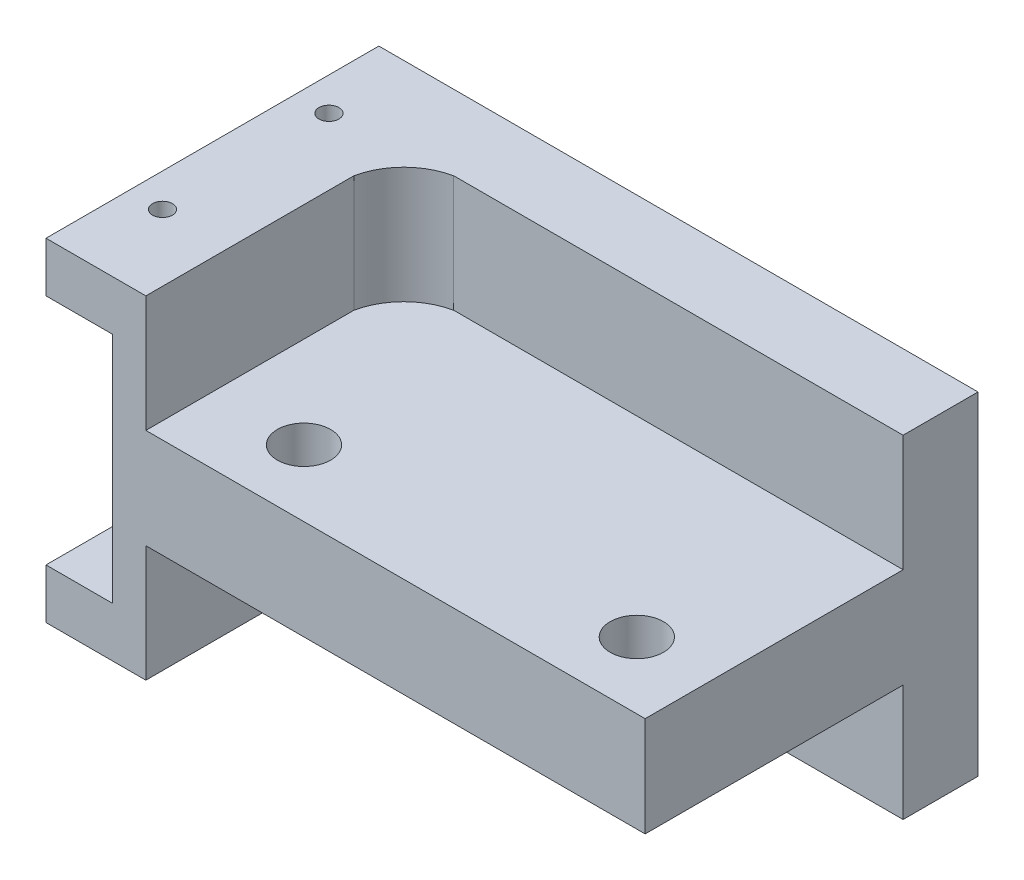
ISO-10303-21;
HEADER;
FILE_DESCRIPTION(('STEP AP214'),'2;1');
FILE_NAME('part.step','',(''),(''),'','','');
FILE_SCHEMA(('AUTOMOTIVE_DESIGN { 1 0 10303 214 1 1 1 1 }'));
ENDSEC;
DATA;
#1=APPLICATION_CONTEXT('core data for automotive mechanical design processes');
#2=APPLICATION_PROTOCOL_DEFINITION('international standard','automotive_design',2000,#1);
#3=PRODUCT_CONTEXT('',#1,'mechanical');
#4=PRODUCT('Part','Part','',(#3));
#5=PRODUCT_RELATED_PRODUCT_CATEGORY('part','',(#4));
#6=PRODUCT_DEFINITION_FORMATION('','',#4);
#7=PRODUCT_DEFINITION_CONTEXT('part definition',#1,'design');
#8=PRODUCT_DEFINITION('design','',#6,#7);
#9=PRODUCT_DEFINITION_SHAPE('','',#8);
#10=(LENGTH_UNIT() NAMED_UNIT(*) SI_UNIT(.MILLI.,.METRE.));
#11=(NAMED_UNIT(*) PLANE_ANGLE_UNIT() SI_UNIT($,.RADIAN.));
#12=(NAMED_UNIT(*) SI_UNIT($,.STERADIAN.) SOLID_ANGLE_UNIT());
#13=UNCERTAINTY_MEASURE_WITH_UNIT(LENGTH_MEASURE(1.E-05),#10,'distance_accuracy_value','');
#14=(GEOMETRIC_REPRESENTATION_CONTEXT(3) GLOBAL_UNCERTAINTY_ASSIGNED_CONTEXT((#13)) GLOBAL_UNIT_ASSIGNED_CONTEXT((#10,
#11,#12)) REPRESENTATION_CONTEXT('',''));
#15=CARTESIAN_POINT('',(0.,0.,0.));
#16=DIRECTION('',(0.,0.,1.));
#17=DIRECTION('',(1.,0.,0.));
#18=AXIS2_PLACEMENT_3D('',#15,#16,#17);
#19=CARTESIAN_POINT('',(17.5,10.,10.));
#20=DIRECTION('',(-1.,0.,0.));
#21=DIRECTION('',(0.,0.,1.));
#22=AXIS2_PLACEMENT_3D('',#19,#20,#21);
#23=PLANE('',#22);
#24=DIRECTION('',(0.,0.,1.));
#25=VECTOR('',#24,1.);
#26=CARTESIAN_POINT('',(17.5,-3.,10.));
#27=LINE('',#26,#25);
#28=CARTESIAN_POINT('',(17.5,-3.,-5.5));
#29=VERTEX_POINT('',#28);
#30=CARTESIAN_POINT('',(17.5,-3.,10.));
#31=VERTEX_POINT('',#30);
#32=EDGE_CURVE('E256',#29,#31,#27,.T.);
#33=ORIENTED_EDGE('',*,*,#32,.F.);
#34=DIRECTION('',(0.,-1.,0.));
#35=VECTOR('',#34,1.);
#36=CARTESIAN_POINT('',(17.5,-3.,-5.5));
#37=LINE('',#36,#35);
#38=CARTESIAN_POINT('',(17.5,-10.,-5.5));
#39=VERTEX_POINT('',#38);
#40=EDGE_CURVE('E264',#29,#39,#37,.T.);
#41=ORIENTED_EDGE('',*,*,#40,.T.);
#42=DIRECTION('',(0.,0.,-1.));
#43=VECTOR('',#42,1.);
#44=CARTESIAN_POINT('',(17.5,-10.,10.));
#45=LINE('',#44,#43);
#46=CARTESIAN_POINT('',(17.5,-10.,-10.));
#47=VERTEX_POINT('',#46);
#48=EDGE_CURVE('E164',#39,#47,#45,.T.);
#49=ORIENTED_EDGE('',*,*,#48,.T.);
#50=DIRECTION('',(0.,-1.,0.));
#51=VECTOR('',#50,1.);
#52=CARTESIAN_POINT('',(17.5,10.,-10.));
#53=LINE('',#52,#51);
#54=CARTESIAN_POINT('',(17.5,10.,-10.));
#55=VERTEX_POINT('',#54);
#56=EDGE_CURVE('E11',#55,#47,#53,.T.);
#57=ORIENTED_EDGE('',*,*,#56,.F.);
#58=DIRECTION('',(0.,0.,-1.));
#59=VECTOR('',#58,1.);
#60=CARTESIAN_POINT('',(17.5,10.,10.));
#61=LINE('',#60,#59);
#62=CARTESIAN_POINT('',(17.5,10.,-5.5));
#63=VERTEX_POINT('',#62);
#64=EDGE_CURVE('E303',#63,#55,#61,.T.);
#65=ORIENTED_EDGE('',*,*,#64,.F.);
#66=DIRECTION('',(0.,1.,0.));
#67=VECTOR('',#66,1.);
#68=CARTESIAN_POINT('',(17.5,3.,-5.5));
#69=LINE('',#68,#67);
#70=CARTESIAN_POINT('',(17.5,3.,-5.5));
#71=VERTEX_POINT('',#70);
#72=EDGE_CURVE('E288',#71,#63,#69,.T.);
#73=ORIENTED_EDGE('',*,*,#72,.F.);
#74=DIRECTION('',(0.,0.,-1.));
#75=VECTOR('',#74,1.);
#76=CARTESIAN_POINT('',(17.5,3.,-5.5));
#77=LINE('',#76,#75);
#78=CARTESIAN_POINT('',(17.5,3.,10.));
#79=VERTEX_POINT('',#78);
#80=EDGE_CURVE('E275',#79,#71,#77,.T.);
#81=ORIENTED_EDGE('',*,*,#80,.F.);
#82=DIRECTION('',(0.,-1.,0.));
#83=VECTOR('',#82,1.);
#84=CARTESIAN_POINT('',(17.5,10.,10.));
#85=LINE('',#84,#83);
#86=EDGE_CURVE('E45',#79,#31,#85,.T.);
#87=ORIENTED_EDGE('',*,*,#86,.T.);
#88=EDGE_LOOP('',(#33,#41,#49,#57,#65,#73,#81,#87));
#89=FACE_BOUND('',#88,.T.);
#90=ADVANCED_FACE('F37',(#89),#23,.F.);
#91=CARTESIAN_POINT('',(-17.5,10.,-10.));
#92=DIRECTION('',(0.,0.,1.));
#93=DIRECTION('',(1.,0.,0.));
#94=AXIS2_PLACEMENT_3D('',#91,#92,#93);
#95=PLANE('',#94);
#96=DIRECTION('',(0.,-1.,0.));
#97=VECTOR('',#96,1.);
#98=CARTESIAN_POINT('',(-14.5,7.,-10.));
#99=LINE('',#98,#97);
#100=CARTESIAN_POINT('',(-14.5,7.,-10.));
#101=VERTEX_POINT('',#100);
#102=CARTESIAN_POINT('',(-14.5,-7.,-10.));
#103=VERTEX_POINT('',#102);
#104=EDGE_CURVE('E212',#101,#103,#99,.T.);
#105=ORIENTED_EDGE('',*,*,#104,.F.);
#106=DIRECTION('',(-1.,0.,0.));
#107=VECTOR('',#106,1.);
#108=CARTESIAN_POINT('',(-14.5,7.,-10.));
#109=LINE('',#108,#107);
#110=CARTESIAN_POINT('',(-18.5,7.,-10.));
#111=VERTEX_POINT('',#110);
#112=EDGE_CURVE('E229',#101,#111,#109,.T.);
#113=ORIENTED_EDGE('',*,*,#112,.T.);
#114=DIRECTION('',(0.,-1.,0.));
#115=VECTOR('',#114,1.);
#116=CARTESIAN_POINT('',(-18.5,10.,-10.));
#117=LINE('',#116,#115);
#118=CARTESIAN_POINT('',(-18.5,10.,-10.));
#119=VERTEX_POINT('',#118);
#120=EDGE_CURVE('E184',#119,#111,#117,.T.);
#121=ORIENTED_EDGE('',*,*,#120,.F.);
#122=DIRECTION('',(-1.,0.,0.));
#123=VECTOR('',#122,1.);
#124=CARTESIAN_POINT('',(-17.5,10.,-10.));
#125=LINE('',#124,#123);
#126=EDGE_CURVE('E305',#55,#119,#125,.T.);
#127=ORIENTED_EDGE('',*,*,#126,.F.);
#128=ORIENTED_EDGE('',*,*,#56,.T.);
#129=DIRECTION('',(-1.,0.,0.));
#130=VECTOR('',#129,1.);
#131=CARTESIAN_POINT('',(-17.5,-10.,-10.));
#132=LINE('',#131,#130);
#133=CARTESIAN_POINT('',(-18.5,-10.,-10.));
#134=VERTEX_POINT('',#133);
#135=EDGE_CURVE('E152',#47,#134,#132,.T.);
#136=ORIENTED_EDGE('',*,*,#135,.T.);
#137=DIRECTION('',(0.,-1.,0.));
#138=VECTOR('',#137,1.);
#139=CARTESIAN_POINT('',(-18.5,-7.,-10.));
#140=LINE('',#139,#138);
#141=CARTESIAN_POINT('',(-18.5,-7.,-10.));
#142=VERTEX_POINT('',#141);
#143=EDGE_CURVE('E158',#142,#134,#140,.T.);
#144=ORIENTED_EDGE('',*,*,#143,.F.);
#145=DIRECTION('',(-1.,0.,0.));
#146=VECTOR('',#145,1.);
#147=CARTESIAN_POINT('',(-14.5,-7.,-10.));
#148=LINE('',#147,#146);
#149=EDGE_CURVE('E228',#103,#142,#148,.T.);
#150=ORIENTED_EDGE('',*,*,#149,.F.);
#151=EDGE_LOOP('',(#105,#113,#121,#127,#128,#136,#144,#150));
#152=FACE_BOUND('',#151,.T.);
#153=ADVANCED_FACE('F155',(#152),#95,.F.);
#154=CARTESIAN_POINT('',(-17.5,10.,10.));
#155=DIRECTION('',(0.,0.,-1.));
#156=DIRECTION('',(-1.,0.,0.));
#157=AXIS2_PLACEMENT_3D('',#154,#155,#156);
#158=PLANE('',#157);
#159=DIRECTION('',(1.,0.,0.));
#160=VECTOR('',#159,1.);
#161=CARTESIAN_POINT('',(-17.5,10.,10.));
#162=LINE('',#161,#160);
#163=CARTESIAN_POINT('',(-18.5,10.,10.));
#164=VERTEX_POINT('',#163);
#165=CARTESIAN_POINT('',(-12.5,10.,10.));
#166=VERTEX_POINT('',#165);
#167=EDGE_CURVE('E307',#164,#166,#162,.T.);
#168=ORIENTED_EDGE('',*,*,#167,.F.);
#169=DIRECTION('',(0.,1.,0.));
#170=VECTOR('',#169,1.);
#171=CARTESIAN_POINT('',(-18.5,10.,10.));
#172=LINE('',#171,#170);
#173=CARTESIAN_POINT('',(-18.5,7.,10.));
#174=VERTEX_POINT('',#173);
#175=EDGE_CURVE('E190',#174,#164,#172,.T.);
#176=ORIENTED_EDGE('',*,*,#175,.F.);
#177=DIRECTION('',(-1.,0.,0.));
#178=VECTOR('',#177,1.);
#179=CARTESIAN_POINT('',(-14.5,7.,10.));
#180=LINE('',#179,#178);
#181=CARTESIAN_POINT('',(-14.5,7.,10.));
#182=VERTEX_POINT('',#181);
#183=EDGE_CURVE('E232',#182,#174,#180,.T.);
#184=ORIENTED_EDGE('',*,*,#183,.F.);
#185=DIRECTION('',(0.,1.,0.));
#186=VECTOR('',#185,1.);
#187=CARTESIAN_POINT('',(-14.5,7.,10.));
#188=LINE('',#187,#186);
#189=CARTESIAN_POINT('',(-14.5,-7.,10.));
#190=VERTEX_POINT('',#189);
#191=EDGE_CURVE('E223',#190,#182,#188,.T.);
#192=ORIENTED_EDGE('',*,*,#191,.F.);
#193=DIRECTION('',(-1.,0.,0.));
#194=VECTOR('',#193,1.);
#195=CARTESIAN_POINT('',(-14.5,-7.,10.));
#196=LINE('',#195,#194);
#197=CARTESIAN_POINT('',(-18.5,-7.,10.));
#198=VERTEX_POINT('',#197);
#199=EDGE_CURVE('E234',#190,#198,#196,.T.);
#200=ORIENTED_EDGE('',*,*,#199,.T.);
#201=DIRECTION('',(0.,1.,0.));
#202=VECTOR('',#201,1.);
#203=CARTESIAN_POINT('',(-18.5,-7.,10.));
#204=LINE('',#203,#202);
#205=CARTESIAN_POINT('',(-18.5,-10.,10.));
#206=VERTEX_POINT('',#205);
#207=EDGE_CURVE('E174',#206,#198,#204,.T.);
#208=ORIENTED_EDGE('',*,*,#207,.F.);
#209=DIRECTION('',(1.,0.,0.));
#210=VECTOR('',#209,1.);
#211=CARTESIAN_POINT('',(-17.5,-10.,10.));
#212=LINE('',#211,#210);
#213=CARTESIAN_POINT('',(-12.5,-10.,10.));
#214=VERTEX_POINT('',#213);
#215=EDGE_CURVE('E163',#206,#214,#212,.T.);
#216=ORIENTED_EDGE('',*,*,#215,.T.);
#217=DIRECTION('',(0.,-1.,0.));
#218=VECTOR('',#217,1.);
#219=CARTESIAN_POINT('',(-12.5,-3.,10.));
#220=LINE('',#219,#218);
#221=CARTESIAN_POINT('',(-12.5,-3.,10.));
#222=VERTEX_POINT('',#221);
#223=EDGE_CURVE('E61',#222,#214,#220,.T.);
#224=ORIENTED_EDGE('',*,*,#223,.F.);
#225=DIRECTION('',(-1.,0.,0.));
#226=VECTOR('',#225,1.);
#227=CARTESIAN_POINT('',(-12.5,-3.,10.));
#228=LINE('',#227,#226);
#229=EDGE_CURVE('E243',#31,#222,#228,.T.);
#230=ORIENTED_EDGE('',*,*,#229,.F.);
#231=ORIENTED_EDGE('',*,*,#86,.F.);
#232=DIRECTION('',(1.,0.,0.));
#233=VECTOR('',#232,1.);
#234=CARTESIAN_POINT('',(17.5,3.,10.));
#235=LINE('',#234,#233);
#236=CARTESIAN_POINT('',(-12.5,3.,10.));
#237=VERTEX_POINT('',#236);
#238=EDGE_CURVE('E273',#237,#79,#235,.T.);
#239=ORIENTED_EDGE('',*,*,#238,.F.);
#240=DIRECTION('',(0.,1.,0.));
#241=VECTOR('',#240,1.);
#242=CARTESIAN_POINT('',(-12.5,3.,10.));
#243=LINE('',#242,#241);
#244=EDGE_CURVE('E295',#237,#166,#243,.T.);
#245=ORIENTED_EDGE('',*,*,#244,.T.);
#246=EDGE_LOOP('',(#168,#176,#184,#192,#200,#208,#216,#224,#230,#231,#239,#245));
#247=FACE_BOUND('',#246,.T.);
#248=ADVANCED_FACE('F333',(#247),#158,.F.);
#249=CARTESIAN_POINT('',(0.,10.,0.));
#250=DIRECTION('',(0.,-1.,0.));
#251=DIRECTION('',(0.,0.,-1.));
#252=AXIS2_PLACEMENT_3D('',#249,#250,#251);
#253=PLANE('',#252);
#254=CARTESIAN_POINT('',(-16.5,10.,-5.));
#255=DIRECTION('',(0.,1.,0.));
#256=DIRECTION('',(0.,0.,1.));
#257=AXIS2_PLACEMENT_3D('',#254,#255,#256);
#258=CIRCLE('',#257,0.6);
#259=CARTESIAN_POINT('',(-16.5,10.,-4.4));
#260=VERTEX_POINT('',#259);
#261=EDGE_CURVE('E213',#260,#260,#258,.T.);
#262=ORIENTED_EDGE('',*,*,#261,.F.);
#263=EDGE_LOOP('',(#262));
#264=FACE_BOUND('',#263,.T.);
#265=CARTESIAN_POINT('',(-16.5,10.,5.));
#266=DIRECTION('',(0.,1.,0.));
#267=DIRECTION('',(0.,0.,1.));
#268=AXIS2_PLACEMENT_3D('',#265,#266,#267);
#269=CIRCLE('',#268,0.6);
#270=CARTESIAN_POINT('',(-16.5,10.,5.6));
#271=VERTEX_POINT('',#270);
#272=EDGE_CURVE('E200',#271,#271,#269,.T.);
#273=ORIENTED_EDGE('',*,*,#272,.F.);
#274=EDGE_LOOP('',(#273));
#275=FACE_BOUND('',#274,.T.);
#276=ORIENTED_EDGE('',*,*,#167,.T.);
#277=DIRECTION('',(0.,0.,1.));
#278=VECTOR('',#277,1.);
#279=CARTESIAN_POINT('',(-12.5,10.,10.));
#280=LINE('',#279,#278);
#281=CARTESIAN_POINT('',(-12.5,10.,-2.5));
#282=VERTEX_POINT('',#281);
#283=EDGE_CURVE('E276',#282,#166,#280,.T.);
#284=ORIENTED_EDGE('',*,*,#283,.F.);
#285=CARTESIAN_POINT('',(-8.70810267121714,10.,-1.70810267121714));
#286=DIRECTION('',(0.,1.,0.));
#287=DIRECTION('',(0.,0.,-1.));
#288=AXIS2_PLACEMENT_3D('',#285,#286,#287);
#289=CIRCLE('',#288,3.87370452298108);
#290=CARTESIAN_POINT('',(-9.5,10.,-5.5));
#291=VERTEX_POINT('',#290);
#292=EDGE_CURVE('E291',#291,#282,#289,.T.);
#293=ORIENTED_EDGE('',*,*,#292,.F.);
#294=DIRECTION('',(-1.,0.,0.));
#295=VECTOR('',#294,1.);
#296=CARTESIAN_POINT('',(-9.5,10.,-5.5));
#297=LINE('',#296,#295);
#298=EDGE_CURVE('E267',#63,#291,#297,.T.);
#299=ORIENTED_EDGE('',*,*,#298,.F.);
#300=ORIENTED_EDGE('',*,*,#64,.T.);
#301=ORIENTED_EDGE('',*,*,#126,.T.);
#302=DIRECTION('',(0.,0.,-1.));
#303=VECTOR('',#302,1.);
#304=CARTESIAN_POINT('',(-18.5,10.,-10.));
#305=LINE('',#304,#303);
#306=EDGE_CURVE('E193',#164,#119,#305,.T.);
#307=ORIENTED_EDGE('',*,*,#306,.F.);
#308=EDGE_LOOP('',(#276,#284,#293,#299,#300,#301,#307));
#309=FACE_BOUND('',#308,.T.);
#310=ADVANCED_FACE('F349',(#264,#275,#309),#253,.F.);
#311=CARTESIAN_POINT('',(0.,-10.,0.));
#312=DIRECTION('',(0.,-1.,0.));
#313=DIRECTION('',(0.,0.,-1.));
#314=AXIS2_PLACEMENT_3D('',#311,#312,#313);
#315=PLANE('',#314);
#316=CARTESIAN_POINT('',(-16.5,-10.,5.));
#317=DIRECTION('',(0.,-1.,0.));
#318=DIRECTION('',(0.,0.,-1.));
#319=AXIS2_PLACEMENT_3D('',#316,#317,#318);
#320=CIRCLE('',#319,0.6);
#321=CARTESIAN_POINT('',(-16.5,-10.,4.4));
#322=VERTEX_POINT('',#321);
#323=EDGE_CURVE('E201',#322,#322,#320,.T.);
#324=ORIENTED_EDGE('',*,*,#323,.F.);
#325=EDGE_LOOP('',(#324));
#326=FACE_BOUND('',#325,.T.);
#327=CARTESIAN_POINT('',(-16.5,-10.,-5.));
#328=DIRECTION('',(0.,-1.,0.));
#329=DIRECTION('',(0.,0.,-1.));
#330=AXIS2_PLACEMENT_3D('',#327,#328,#329);
#331=CIRCLE('',#330,0.6);
#332=CARTESIAN_POINT('',(-16.5,-10.,-5.6));
#333=VERTEX_POINT('',#332);
#334=EDGE_CURVE('E196',#333,#333,#331,.T.);
#335=ORIENTED_EDGE('',*,*,#334,.F.);
#336=EDGE_LOOP('',(#335));
#337=FACE_BOUND('',#336,.T.);
#338=DIRECTION('',(1.,0.,0.));
#339=VECTOR('',#338,1.);
#340=CARTESIAN_POINT('',(-9.5,-10.,-5.5));
#341=LINE('',#340,#339);
#342=CARTESIAN_POINT('',(-9.5,-10.,-5.5));
#343=VERTEX_POINT('',#342);
#344=EDGE_CURVE('E247',#343,#39,#341,.T.);
#345=ORIENTED_EDGE('',*,*,#344,.F.);
#346=CARTESIAN_POINT('',(-9.13466706674538,-10.,-2.13466706674538));
#347=DIRECTION('',(0.,-1.,0.));
#348=DIRECTION('',(0.,0.,-1.));
#349=AXIS2_PLACEMENT_3D('',#346,#347,#348);
#350=CIRCLE('',#349,3.38510471090166);
#351=CARTESIAN_POINT('',(-12.5,-10.,-2.5));
#352=VERTEX_POINT('',#351);
#353=EDGE_CURVE('E260',#352,#343,#350,.T.);
#354=ORIENTED_EDGE('',*,*,#353,.F.);
#355=DIRECTION('',(0.,0.,-1.));
#356=VECTOR('',#355,1.);
#357=CARTESIAN_POINT('',(-12.5,-10.,10.));
#358=LINE('',#357,#356);
#359=EDGE_CURVE('E258',#214,#352,#358,.T.);
#360=ORIENTED_EDGE('',*,*,#359,.F.);
#361=ORIENTED_EDGE('',*,*,#215,.F.);
#362=DIRECTION('',(0.,0.,1.));
#363=VECTOR('',#362,1.);
#364=CARTESIAN_POINT('',(-18.5,-10.,-10.));
#365=LINE('',#364,#363);
#366=EDGE_CURVE('E167',#134,#206,#365,.T.);
#367=ORIENTED_EDGE('',*,*,#366,.F.);
#368=ORIENTED_EDGE('',*,*,#135,.F.);
#369=ORIENTED_EDGE('',*,*,#48,.F.);
#370=EDGE_LOOP('',(#345,#354,#360,#361,#367,#368,#369));
#371=FACE_BOUND('',#370,.T.);
#372=ADVANCED_FACE('F169',(#326,#337,#371),#315,.T.);
#373=CARTESIAN_POINT('',(-12.5,3.,10.));
#374=DIRECTION('',(-1.,0.,0.));
#375=DIRECTION('',(0.,0.,1.));
#376=AXIS2_PLACEMENT_3D('',#373,#374,#375);
#377=PLANE('',#376);
#378=ORIENTED_EDGE('',*,*,#283,.T.);
#379=ORIENTED_EDGE('',*,*,#244,.F.);
#380=DIRECTION('',(0.,0.,1.));
#381=VECTOR('',#380,1.);
#382=CARTESIAN_POINT('',(-12.5,3.,10.));
#383=LINE('',#382,#381);
#384=CARTESIAN_POINT('',(-12.5,3.,-2.5));
#385=VERTEX_POINT('',#384);
#386=EDGE_CURVE('E285',#385,#237,#383,.T.);
#387=ORIENTED_EDGE('',*,*,#386,.F.);
#388=DIRECTION('',(0.,1.,0.));
#389=VECTOR('',#388,1.);
#390=CARTESIAN_POINT('',(-12.5,3.,-2.5));
#391=LINE('',#390,#389);
#392=EDGE_CURVE('E298',#385,#282,#391,.T.);
#393=ORIENTED_EDGE('',*,*,#392,.T.);
#394=EDGE_LOOP('',(#378,#379,#387,#393));
#395=FACE_BOUND('',#394,.T.);
#396=ADVANCED_FACE('F380',(#395),#377,.F.);
#397=CARTESIAN_POINT('',(-8.70810267121714,3.,-1.70810267121714));
#398=DIRECTION('',(0.,1.,0.));
#399=DIRECTION('',(0.,0.,1.));
#400=AXIS2_PLACEMENT_3D('',#397,#398,#399);
#401=CYLINDRICAL_SURFACE('',#400,3.87370452298108);
#402=ORIENTED_EDGE('',*,*,#292,.T.);
#403=ORIENTED_EDGE('',*,*,#392,.F.);
#404=CARTESIAN_POINT('',(-8.70810267121714,3.,-1.70810267121714));
#405=DIRECTION('',(0.,1.,0.));
#406=DIRECTION('',(0.,0.,-1.));
#407=AXIS2_PLACEMENT_3D('',#404,#405,#406);
#408=CIRCLE('',#407,3.87370452298108);
#409=CARTESIAN_POINT('',(-9.5,3.,-5.5));
#410=VERTEX_POINT('',#409);
#411=EDGE_CURVE('E282',#410,#385,#408,.T.);
#412=ORIENTED_EDGE('',*,*,#411,.F.);
#413=DIRECTION('',(0.,1.,0.));
#414=VECTOR('',#413,1.);
#415=CARTESIAN_POINT('',(-9.5,3.,-5.5));
#416=LINE('',#415,#414);
#417=EDGE_CURVE('E300',#410,#291,#416,.T.);
#418=ORIENTED_EDGE('',*,*,#417,.T.);
#419=EDGE_LOOP('',(#402,#403,#412,#418));
#420=FACE_BOUND('',#419,.T.);
#421=ADVANCED_FACE('F389',(#420),#401,.F.);
#422=CARTESIAN_POINT('',(-9.5,3.,-5.5));
#423=DIRECTION('',(0.,0.,-1.));
#424=DIRECTION('',(-1.,0.,0.));
#425=AXIS2_PLACEMENT_3D('',#422,#423,#424);
#426=PLANE('',#425);
#427=ORIENTED_EDGE('',*,*,#298,.T.);
#428=ORIENTED_EDGE('',*,*,#417,.F.);
#429=DIRECTION('',(-1.,0.,0.));
#430=VECTOR('',#429,1.);
#431=CARTESIAN_POINT('',(-9.5,3.,-5.5));
#432=LINE('',#431,#430);
#433=EDGE_CURVE('E279',#71,#410,#432,.T.);
#434=ORIENTED_EDGE('',*,*,#433,.F.);
#435=ORIENTED_EDGE('',*,*,#72,.T.);
#436=EDGE_LOOP('',(#427,#428,#434,#435));
#437=FACE_BOUND('',#436,.T.);
#438=ADVANCED_FACE('F385',(#437),#426,.F.);
#439=CARTESIAN_POINT('',(-8.70810267121714,3.,-1.70810267121714));
#440=DIRECTION('',(0.,-1.,0.));
#441=DIRECTION('',(0.,0.,-1.));
#442=AXIS2_PLACEMENT_3D('',#439,#440,#441);
#443=PLANE('',#442);
#444=CARTESIAN_POINT('',(-7.,3.,6.));
#445=DIRECTION('',(0.,1.,0.));
#446=DIRECTION('',(0.,0.,1.));
#447=AXIS2_PLACEMENT_3D('',#444,#445,#446);
#448=CIRCLE('',#447,1.6);
#449=CARTESIAN_POINT('',(-7.,3.,7.6));
#450=VERTEX_POINT('',#449);
#451=EDGE_CURVE('E237',#450,#450,#448,.T.);
#452=ORIENTED_EDGE('',*,*,#451,.F.);
#453=EDGE_LOOP('',(#452));
#454=FACE_BOUND('',#453,.T.);
#455=CARTESIAN_POINT('',(13.,3.,6.));
#456=DIRECTION('',(0.,1.,0.));
#457=DIRECTION('',(0.,0.,1.));
#458=AXIS2_PLACEMENT_3D('',#455,#456,#457);
#459=CIRCLE('',#458,1.6);
#460=CARTESIAN_POINT('',(13.,3.,7.6));
#461=VERTEX_POINT('',#460);
#462=EDGE_CURVE('E231',#461,#461,#459,.T.);
#463=ORIENTED_EDGE('',*,*,#462,.F.);
#464=EDGE_LOOP('',(#463));
#465=FACE_BOUND('',#464,.T.);
#466=ORIENTED_EDGE('',*,*,#238,.T.);
#467=ORIENTED_EDGE('',*,*,#80,.T.);
#468=ORIENTED_EDGE('',*,*,#433,.T.);
#469=ORIENTED_EDGE('',*,*,#411,.T.);
#470=ORIENTED_EDGE('',*,*,#386,.T.);
#471=EDGE_LOOP('',(#466,#467,#468,#469,#470));
#472=FACE_BOUND('',#471,.T.);
#473=ADVANCED_FACE('F388',(#454,#465,#472),#443,.F.);
#474=CARTESIAN_POINT('',(-9.5,-3.,-5.5));
#475=DIRECTION('',(0.,0.,-1.));
#476=DIRECTION('',(-1.,0.,0.));
#477=AXIS2_PLACEMENT_3D('',#474,#475,#476);
#478=PLANE('',#477);
#479=ORIENTED_EDGE('',*,*,#344,.T.);
#480=ORIENTED_EDGE('',*,*,#40,.F.);
#481=DIRECTION('',(1.,0.,0.));
#482=VECTOR('',#481,1.);
#483=CARTESIAN_POINT('',(-9.5,-3.,-5.5));
#484=LINE('',#483,#482);
#485=CARTESIAN_POINT('',(-9.5,-3.,-5.5));
#486=VERTEX_POINT('',#485);
#487=EDGE_CURVE('E253',#486,#29,#484,.T.);
#488=ORIENTED_EDGE('',*,*,#487,.F.);
#489=DIRECTION('',(0.,-1.,0.));
#490=VECTOR('',#489,1.);
#491=CARTESIAN_POINT('',(-9.5,-3.,-5.5));
#492=LINE('',#491,#490);
#493=EDGE_CURVE('E268',#486,#343,#492,.T.);
#494=ORIENTED_EDGE('',*,*,#493,.T.);
#495=EDGE_LOOP('',(#479,#480,#488,#494));
#496=FACE_BOUND('',#495,.T.);
#497=ADVANCED_FACE('F357',(#496),#478,.F.);
#498=CARTESIAN_POINT('',(-9.13466706674538,-3.,-2.13466706674538));
#499=DIRECTION('',(0.,-1.,0.));
#500=DIRECTION('',(0.,0.,-1.));
#501=AXIS2_PLACEMENT_3D('',#498,#499,#500);
#502=CYLINDRICAL_SURFACE('',#501,3.38510471090166);
#503=ORIENTED_EDGE('',*,*,#353,.T.);
#504=ORIENTED_EDGE('',*,*,#493,.F.);
#505=CARTESIAN_POINT('',(-9.13466706674538,-3.,-2.13466706674538));
#506=DIRECTION('',(0.,-1.,0.));
#507=DIRECTION('',(0.,0.,-1.));
#508=AXIS2_PLACEMENT_3D('',#505,#506,#507);
#509=CIRCLE('',#508,3.38510471090166);
#510=CARTESIAN_POINT('',(-12.5,-3.,-2.5));
#511=VERTEX_POINT('',#510);
#512=EDGE_CURVE('E250',#511,#486,#509,.T.);
#513=ORIENTED_EDGE('',*,*,#512,.F.);
#514=DIRECTION('',(0.,-1.,0.));
#515=VECTOR('',#514,1.);
#516=CARTESIAN_POINT('',(-12.5,-3.,-2.5));
#517=LINE('',#516,#515);
#518=EDGE_CURVE('E270',#511,#352,#517,.T.);
#519=ORIENTED_EDGE('',*,*,#518,.T.);
#520=EDGE_LOOP('',(#503,#504,#513,#519));
#521=FACE_BOUND('',#520,.T.);
#522=ADVANCED_FACE('F361',(#521),#502,.F.);
#523=CARTESIAN_POINT('',(-12.5,-3.,10.));
#524=DIRECTION('',(-1.,0.,0.));
#525=DIRECTION('',(0.,0.,1.));
#526=AXIS2_PLACEMENT_3D('',#523,#524,#525);
#527=PLANE('',#526);
#528=ORIENTED_EDGE('',*,*,#359,.T.);
#529=ORIENTED_EDGE('',*,*,#518,.F.);
#530=DIRECTION('',(0.,0.,-1.));
#531=VECTOR('',#530,1.);
#532=CARTESIAN_POINT('',(-12.5,-3.,10.));
#533=LINE('',#532,#531);
#534=EDGE_CURVE('E246',#222,#511,#533,.T.);
#535=ORIENTED_EDGE('',*,*,#534,.F.);
#536=ORIENTED_EDGE('',*,*,#223,.T.);
#537=EDGE_LOOP('',(#528,#529,#535,#536));
#538=FACE_BOUND('',#537,.T.);
#539=ADVANCED_FACE('F326',(#538),#527,.F.);
#540=CARTESIAN_POINT('',(-9.13466706674538,-3.,-2.13466706674538));
#541=DIRECTION('',(0.,-1.,0.));
#542=DIRECTION('',(0.,0.,-1.));
#543=AXIS2_PLACEMENT_3D('',#540,#541,#542);
#544=PLANE('',#543);
#545=CARTESIAN_POINT('',(-7.,-3.,6.));
#546=DIRECTION('',(0.,-1.,0.));
#547=DIRECTION('',(0.,0.,-1.));
#548=AXIS2_PLACEMENT_3D('',#545,#546,#547);
#549=CIRCLE('',#548,1.6);
#550=CARTESIAN_POINT('',(-7.,-3.,4.4));
#551=VERTEX_POINT('',#550);
#552=EDGE_CURVE('E40',#551,#551,#549,.T.);
#553=ORIENTED_EDGE('',*,*,#552,.F.);
#554=EDGE_LOOP('',(#553));
#555=FACE_BOUND('',#554,.T.);
#556=CARTESIAN_POINT('',(13.,-3.,6.));
#557=DIRECTION('',(0.,-1.,0.));
#558=DIRECTION('',(0.,0.,-1.));
#559=AXIS2_PLACEMENT_3D('',#556,#557,#558);
#560=CIRCLE('',#559,1.6);
#561=CARTESIAN_POINT('',(13.,-3.,4.4));
#562=VERTEX_POINT('',#561);
#563=EDGE_CURVE('E240',#562,#562,#560,.T.);
#564=ORIENTED_EDGE('',*,*,#563,.F.);
#565=EDGE_LOOP('',(#564));
#566=FACE_BOUND('',#565,.T.);
#567=ORIENTED_EDGE('',*,*,#229,.T.);
#568=ORIENTED_EDGE('',*,*,#534,.T.);
#569=ORIENTED_EDGE('',*,*,#512,.T.);
#570=ORIENTED_EDGE('',*,*,#487,.T.);
#571=ORIENTED_EDGE('',*,*,#32,.T.);
#572=EDGE_LOOP('',(#567,#568,#569,#570,#571));
#573=FACE_BOUND('',#572,.T.);
#574=ADVANCED_FACE('F322',(#555,#566,#573),#544,.T.);
#575=CARTESIAN_POINT('',(13.,-4.,6.));
#576=DIRECTION('',(0.,1.,0.));
#577=DIRECTION('',(0.,0.,1.));
#578=AXIS2_PLACEMENT_3D('',#575,#576,#577);
#579=CYLINDRICAL_SURFACE('',#578,1.6);
#580=ORIENTED_EDGE('',*,*,#563,.T.);
#581=EDGE_LOOP('',(#580));
#582=FACE_BOUND('',#581,.T.);
#583=ORIENTED_EDGE('',*,*,#462,.T.);
#584=EDGE_LOOP('',(#583));
#585=FACE_BOUND('',#584,.T.);
#586=ADVANCED_FACE('F325',(#582,#585),#579,.F.);
#587=CARTESIAN_POINT('',(-7.,-4.,6.));
#588=DIRECTION('',(0.,1.,0.));
#589=DIRECTION('',(0.,0.,1.));
#590=AXIS2_PLACEMENT_3D('',#587,#588,#589);
#591=CYLINDRICAL_SURFACE('',#590,1.6);
#592=ORIENTED_EDGE('',*,*,#552,.T.);
#593=EDGE_LOOP('',(#592));
#594=FACE_BOUND('',#593,.T.);
#595=ORIENTED_EDGE('',*,*,#451,.T.);
#596=EDGE_LOOP('',(#595));
#597=FACE_BOUND('',#596,.T.);
#598=ADVANCED_FACE('F319',(#594,#597),#591,.F.);
#599=CARTESIAN_POINT('',(-14.5,7.,-10.));
#600=DIRECTION('',(0.,1.,0.));
#601=DIRECTION('',(0.,0.,1.));
#602=AXIS2_PLACEMENT_3D('',#599,#600,#601);
#603=PLANE('',#602);
#604=CARTESIAN_POINT('',(-16.5,7.,-5.));
#605=DIRECTION('',(0.,1.,0.));
#606=DIRECTION('',(0.,0.,1.));
#607=AXIS2_PLACEMENT_3D('',#604,#605,#606);
#608=CIRCLE('',#607,0.6);
#609=CARTESIAN_POINT('',(-16.5,7.,-4.4));
#610=VERTEX_POINT('',#609);
#611=EDGE_CURVE('E209',#610,#610,#608,.T.);
#612=ORIENTED_EDGE('',*,*,#611,.T.);
#613=EDGE_LOOP('',(#612));
#614=FACE_BOUND('',#613,.T.);
#615=CARTESIAN_POINT('',(-16.5,7.,5.));
#616=DIRECTION('',(0.,1.,0.));
#617=DIRECTION('',(0.,0.,1.));
#618=AXIS2_PLACEMENT_3D('',#615,#616,#617);
#619=CIRCLE('',#618,0.6);
#620=CARTESIAN_POINT('',(-16.5,7.,5.6));
#621=VERTEX_POINT('',#620);
#622=EDGE_CURVE('E216',#621,#621,#619,.T.);
#623=ORIENTED_EDGE('',*,*,#622,.T.);
#624=EDGE_LOOP('',(#623));
#625=FACE_BOUND('',#624,.T.);
#626=ORIENTED_EDGE('',*,*,#183,.T.);
#627=DIRECTION('',(0.,0.,1.));
#628=VECTOR('',#627,1.);
#629=CARTESIAN_POINT('',(-18.5,7.,-10.));
#630=LINE('',#629,#628);
#631=EDGE_CURVE('E187',#111,#174,#630,.T.);
#632=ORIENTED_EDGE('',*,*,#631,.F.);
#633=ORIENTED_EDGE('',*,*,#112,.F.);
#634=DIRECTION('',(0.,0.,-1.));
#635=VECTOR('',#634,1.);
#636=CARTESIAN_POINT('',(-14.5,7.,-10.));
#637=LINE('',#636,#635);
#638=EDGE_CURVE('E225',#182,#101,#637,.T.);
#639=ORIENTED_EDGE('',*,*,#638,.F.);
#640=EDGE_LOOP('',(#626,#632,#633,#639));
#641=FACE_BOUND('',#640,.T.);
#642=ADVANCED_FACE('F343',(#614,#625,#641),#603,.F.);
#643=CARTESIAN_POINT('',(-14.5,-7.,-10.));
#644=DIRECTION('',(0.,-1.,0.));
#645=DIRECTION('',(0.,0.,-1.));
#646=AXIS2_PLACEMENT_3D('',#643,#644,#645);
#647=PLANE('',#646);
#648=CARTESIAN_POINT('',(-16.5,-7.,5.));
#649=DIRECTION('',(0.,-1.,0.));
#650=DIRECTION('',(0.,0.,-1.));
#651=AXIS2_PLACEMENT_3D('',#648,#649,#650);
#652=CIRCLE('',#651,0.6);
#653=CARTESIAN_POINT('',(-16.5,-7.,4.4));
#654=VERTEX_POINT('',#653);
#655=EDGE_CURVE('E197',#654,#654,#652,.T.);
#656=ORIENTED_EDGE('',*,*,#655,.T.);
#657=EDGE_LOOP('',(#656));
#658=FACE_BOUND('',#657,.T.);
#659=CARTESIAN_POINT('',(-16.5,-7.,-5.));
#660=DIRECTION('',(0.,-1.,0.));
#661=DIRECTION('',(0.,0.,-1.));
#662=AXIS2_PLACEMENT_3D('',#659,#660,#661);
#663=CIRCLE('',#662,0.6);
#664=CARTESIAN_POINT('',(-16.5,-7.,-5.6));
#665=VERTEX_POINT('',#664);
#666=EDGE_CURVE('E204',#665,#665,#663,.T.);
#667=ORIENTED_EDGE('',*,*,#666,.T.);
#668=EDGE_LOOP('',(#667));
#669=FACE_BOUND('',#668,.T.);
#670=ORIENTED_EDGE('',*,*,#149,.T.);
#671=DIRECTION('',(0.,0.,-1.));
#672=VECTOR('',#671,1.);
#673=CARTESIAN_POINT('',(-18.5,-7.,-10.));
#674=LINE('',#673,#672);
#675=EDGE_CURVE('E179',#198,#142,#674,.T.);
#676=ORIENTED_EDGE('',*,*,#675,.F.);
#677=ORIENTED_EDGE('',*,*,#199,.F.);
#678=DIRECTION('',(0.,0.,1.));
#679=VECTOR('',#678,1.);
#680=CARTESIAN_POINT('',(-14.5,-7.,-10.));
#681=LINE('',#680,#679);
#682=EDGE_CURVE('E53',#103,#190,#681,.T.);
#683=ORIENTED_EDGE('',*,*,#682,.F.);
#684=EDGE_LOOP('',(#670,#676,#677,#683));
#685=FACE_BOUND('',#684,.T.);
#686=ADVANCED_FACE('F336',(#658,#669,#685),#647,.F.);
#687=CARTESIAN_POINT('',(-14.5,0.,0.));
#688=DIRECTION('',(-1.,0.,0.));
#689=DIRECTION('',(0.,0.,1.));
#690=AXIS2_PLACEMENT_3D('',#687,#688,#689);
#691=PLANE('',#690);
#692=ORIENTED_EDGE('',*,*,#104,.T.);
#693=ORIENTED_EDGE('',*,*,#682,.T.);
#694=ORIENTED_EDGE('',*,*,#191,.T.);
#695=ORIENTED_EDGE('',*,*,#638,.T.);
#696=EDGE_LOOP('',(#692,#693,#694,#695));
#697=FACE_BOUND('',#696,.T.);
#698=ADVANCED_FACE('F339',(#697),#691,.T.);
#699=CARTESIAN_POINT('',(-16.5,7.,5.));
#700=DIRECTION('',(0.,1.,0.));
#701=DIRECTION('',(0.,0.,1.));
#702=AXIS2_PLACEMENT_3D('',#699,#700,#701);
#703=CYLINDRICAL_SURFACE('',#702,0.6);
#704=ORIENTED_EDGE('',*,*,#622,.F.);
#705=EDGE_LOOP('',(#704));
#706=FACE_BOUND('',#705,.T.);
#707=ORIENTED_EDGE('',*,*,#272,.T.);
#708=EDGE_LOOP('',(#707));
#709=FACE_BOUND('',#708,.T.);
#710=ADVANCED_FACE('F427',(#706,#709),#703,.F.);
#711=CARTESIAN_POINT('',(-16.5,7.,-5.));
#712=DIRECTION('',(0.,1.,0.));
#713=DIRECTION('',(0.,0.,1.));
#714=AXIS2_PLACEMENT_3D('',#711,#712,#713);
#715=CYLINDRICAL_SURFACE('',#714,0.6);
#716=ORIENTED_EDGE('',*,*,#611,.F.);
#717=EDGE_LOOP('',(#716));
#718=FACE_BOUND('',#717,.T.);
#719=ORIENTED_EDGE('',*,*,#261,.T.);
#720=EDGE_LOOP('',(#719));
#721=FACE_BOUND('',#720,.T.);
#722=ADVANCED_FACE('F430',(#718,#721),#715,.F.);
#723=CARTESIAN_POINT('',(-16.5,-7.,-5.));
#724=DIRECTION('',(0.,-1.,0.));
#725=DIRECTION('',(0.,0.,-1.));
#726=AXIS2_PLACEMENT_3D('',#723,#724,#725);
#727=CYLINDRICAL_SURFACE('',#726,0.6);
#728=ORIENTED_EDGE('',*,*,#666,.F.);
#729=EDGE_LOOP('',(#728));
#730=FACE_BOUND('',#729,.T.);
#731=ORIENTED_EDGE('',*,*,#334,.T.);
#732=EDGE_LOOP('',(#731));
#733=FACE_BOUND('',#732,.T.);
#734=ADVANCED_FACE('F434',(#730,#733),#727,.F.);
#735=CARTESIAN_POINT('',(-16.5,-7.,5.));
#736=DIRECTION('',(0.,-1.,0.));
#737=DIRECTION('',(0.,0.,-1.));
#738=AXIS2_PLACEMENT_3D('',#735,#736,#737);
#739=CYLINDRICAL_SURFACE('',#738,0.6);
#740=ORIENTED_EDGE('',*,*,#655,.F.);
#741=EDGE_LOOP('',(#740));
#742=FACE_BOUND('',#741,.T.);
#743=ORIENTED_EDGE('',*,*,#323,.T.);
#744=EDGE_LOOP('',(#743));
#745=FACE_BOUND('',#744,.T.);
#746=ADVANCED_FACE('F438',(#742,#745),#739,.F.);
#747=CARTESIAN_POINT('',(-18.5,0.,0.));
#748=DIRECTION('',(-1.,0.,0.));
#749=DIRECTION('',(0.,0.,1.));
#750=AXIS2_PLACEMENT_3D('',#747,#748,#749);
#751=PLANE('',#750);
#752=ORIENTED_EDGE('',*,*,#120,.T.);
#753=ORIENTED_EDGE('',*,*,#631,.T.);
#754=ORIENTED_EDGE('',*,*,#175,.T.);
#755=ORIENTED_EDGE('',*,*,#306,.T.);
#756=EDGE_LOOP('',(#752,#753,#754,#755));
#757=FACE_BOUND('',#756,.T.);
#758=ADVANCED_FACE('F347',(#757),#751,.T.);
#759=CARTESIAN_POINT('',(-18.5,0.,0.));
#760=DIRECTION('',(-1.,0.,0.));
#761=DIRECTION('',(0.,0.,1.));
#762=AXIS2_PLACEMENT_3D('',#759,#760,#761);
#763=PLANE('',#762);
#764=ORIENTED_EDGE('',*,*,#143,.T.);
#765=ORIENTED_EDGE('',*,*,#366,.T.);
#766=ORIENTED_EDGE('',*,*,#207,.T.);
#767=ORIENTED_EDGE('',*,*,#675,.T.);
#768=EDGE_LOOP('',(#764,#765,#766,#767));
#769=FACE_BOUND('',#768,.T.);
#770=ADVANCED_FACE('F177',(#769),#763,.T.);
#771=CLOSED_SHELL('',(#90,#153,#248,#310,#372,#396,#421,#438,#473,#497,#522,#539,#574,#586,#598,
#642,#686,#698,#710,#722,#734,#746,#758,#770));
#772=MANIFOLD_SOLID_BREP('B2',#771);
#773=ADVANCED_BREP_SHAPE_REPRESENTATION('',(#18,#772),#14);
#774=SHAPE_DEFINITION_REPRESENTATION(#9,#773);
ENDSEC;
END-ISO-10303-21;
